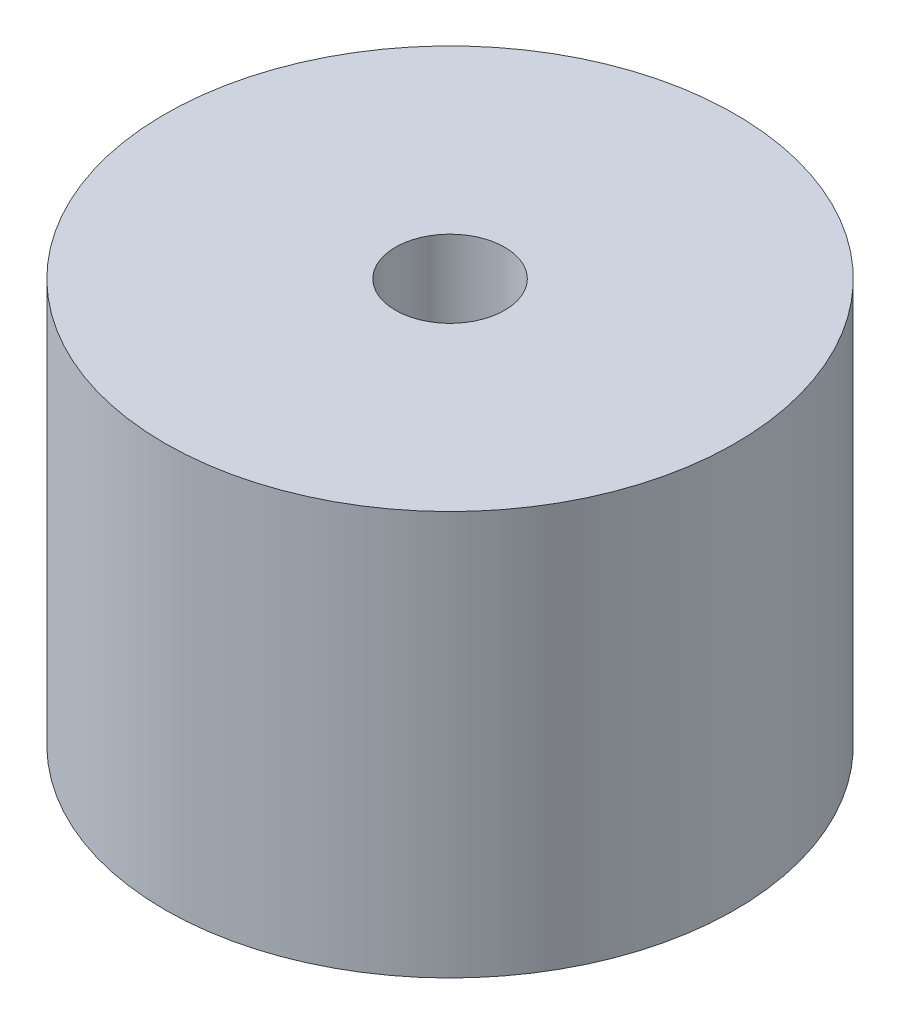
ISO-10303-21;
HEADER;
FILE_DESCRIPTION(('STEP AP214'),'2;1');
FILE_NAME('part.step','',(''),(''),'','','');
FILE_SCHEMA(('AUTOMOTIVE_DESIGN { 1 0 10303 214 1 1 1 1 }'));
ENDSEC;
DATA;
#1=APPLICATION_CONTEXT('core data for automotive mechanical design processes');
#2=APPLICATION_PROTOCOL_DEFINITION('international standard','automotive_design',2000,#1);
#3=PRODUCT_CONTEXT('',#1,'mechanical');
#4=PRODUCT('Part','Part','',(#3));
#5=PRODUCT_RELATED_PRODUCT_CATEGORY('part','',(#4));
#6=PRODUCT_DEFINITION_FORMATION('','',#4);
#7=PRODUCT_DEFINITION_CONTEXT('part definition',#1,'design');
#8=PRODUCT_DEFINITION('design','',#6,#7);
#9=PRODUCT_DEFINITION_SHAPE('','',#8);
#10=(LENGTH_UNIT() NAMED_UNIT(*) SI_UNIT(.MILLI.,.METRE.));
#11=(NAMED_UNIT(*) PLANE_ANGLE_UNIT() SI_UNIT($,.RADIAN.));
#12=(NAMED_UNIT(*) SI_UNIT($,.STERADIAN.) SOLID_ANGLE_UNIT());
#13=UNCERTAINTY_MEASURE_WITH_UNIT(LENGTH_MEASURE(1.E-05),#10,'distance_accuracy_value','');
#14=(GEOMETRIC_REPRESENTATION_CONTEXT(3) GLOBAL_UNCERTAINTY_ASSIGNED_CONTEXT((#13)) GLOBAL_UNIT_ASSIGNED_CONTEXT((#10,
#11,#12)) REPRESENTATION_CONTEXT('',''));
#15=CARTESIAN_POINT('',(0.,0.,0.));
#16=DIRECTION('',(0.,0.,1.));
#17=DIRECTION('',(1.,0.,0.));
#18=AXIS2_PLACEMENT_3D('',#15,#16,#17);
#19=CARTESIAN_POINT('',(0.,8.5,0.));
#20=DIRECTION('',(0.,-1.,0.));
#21=DIRECTION('',(0.,0.,-1.));
#22=AXIS2_PLACEMENT_3D('',#19,#20,#21);
#23=CYLINDRICAL_SURFACE('',#22,6.);
#24=CARTESIAN_POINT('',(0.,8.5,0.));
#25=DIRECTION('',(0.,1.,0.));
#26=DIRECTION('',(0.,0.,1.));
#27=AXIS2_PLACEMENT_3D('',#24,#25,#26);
#28=CIRCLE('',#27,6.);
#29=CARTESIAN_POINT('',(0.,8.5,6.));
#30=VERTEX_POINT('',#29);
#31=EDGE_CURVE('E10',#30,#30,#28,.T.);
#32=ORIENTED_EDGE('',*,*,#31,.F.);
#33=EDGE_LOOP('',(#32));
#34=FACE_BOUND('',#33,.T.);
#35=CARTESIAN_POINT('',(0.,0.,0.));
#36=DIRECTION('',(0.,1.,0.));
#37=DIRECTION('',(0.,0.,1.));
#38=AXIS2_PLACEMENT_3D('',#35,#36,#37);
#39=CIRCLE('',#38,6.);
#40=CARTESIAN_POINT('',(0.,0.,6.));
#41=VERTEX_POINT('',#40);
#42=EDGE_CURVE('E33',#41,#41,#39,.T.);
#43=ORIENTED_EDGE('',*,*,#42,.T.);
#44=EDGE_LOOP('',(#43));
#45=FACE_BOUND('',#44,.T.);
#46=ADVANCED_FACE('F30',(#34,#45),#23,.T.);
#47=CARTESIAN_POINT('',(0.,8.5,0.));
#48=DIRECTION('',(0.,1.,0.));
#49=DIRECTION('',(0.,0.,1.));
#50=AXIS2_PLACEMENT_3D('',#47,#48,#49);
#51=PLANE('',#50);
#52=CARTESIAN_POINT('',(0.,8.5,0.));
#53=DIRECTION('',(0.,1.,0.));
#54=DIRECTION('',(0.,0.,1.));
#55=AXIS2_PLACEMENT_3D('',#52,#53,#54);
#56=CIRCLE('',#55,1.15);
#57=CARTESIAN_POINT('',(0.,8.5,1.15));
#58=VERTEX_POINT('',#57);
#59=EDGE_CURVE('E42',#58,#58,#56,.T.);
#60=ORIENTED_EDGE('',*,*,#59,.F.);
#61=EDGE_LOOP('',(#60));
#62=FACE_BOUND('',#61,.T.);
#63=ORIENTED_EDGE('',*,*,#31,.T.);
#64=EDGE_LOOP('',(#63));
#65=FACE_BOUND('',#64,.T.);
#66=ADVANCED_FACE('F57',(#62,#65),#51,.T.);
#67=CARTESIAN_POINT('',(0.,0.,0.));
#68=DIRECTION('',(0.,1.,0.));
#69=DIRECTION('',(0.,0.,1.));
#70=AXIS2_PLACEMENT_3D('',#67,#68,#69);
#71=PLANE('',#70);
#72=ORIENTED_EDGE('',*,*,#42,.F.);
#73=EDGE_LOOP('',(#72));
#74=FACE_BOUND('',#73,.T.);
#75=ADVANCED_FACE('F53',(#74),#71,.F.);
#76=CARTESIAN_POINT('',(0.,5.5,0.));
#77=DIRECTION('',(0.,1.,0.));
#78=DIRECTION('',(0.,0.,1.));
#79=AXIS2_PLACEMENT_3D('',#76,#77,#78);
#80=CYLINDRICAL_SURFACE('',#79,1.15);
#81=CARTESIAN_POINT('',(0.,5.5,0.));
#82=DIRECTION('',(0.,1.,0.));
#83=DIRECTION('',(0.,0.,1.));
#84=AXIS2_PLACEMENT_3D('',#81,#82,#83);
#85=CIRCLE('',#84,1.15);
#86=CARTESIAN_POINT('',(0.,5.5,1.15));
#87=VERTEX_POINT('',#86);
#88=EDGE_CURVE('E40',#87,#87,#85,.T.);
#89=ORIENTED_EDGE('',*,*,#88,.F.);
#90=EDGE_LOOP('',(#89));
#91=FACE_BOUND('',#90,.T.);
#92=ORIENTED_EDGE('',*,*,#59,.T.);
#93=EDGE_LOOP('',(#92));
#94=FACE_BOUND('',#93,.T.);
#95=ADVANCED_FACE('F50',(#91,#94),#80,.F.);
#96=CARTESIAN_POINT('',(0.,5.5,0.));
#97=DIRECTION('',(0.,1.,0.));
#98=DIRECTION('',(0.,0.,1.));
#99=AXIS2_PLACEMENT_3D('',#96,#97,#98);
#100=PLANE('',#99);
#101=ORIENTED_EDGE('',*,*,#88,.T.);
#102=EDGE_LOOP('',(#101));
#103=FACE_BOUND('',#102,.T.);
#104=ADVANCED_FACE('F48',(#103),#100,.T.);
#105=CLOSED_SHELL('',(#46,#66,#75,#95,#104));
#106=MANIFOLD_SOLID_BREP('B2',#105);
#107=ADVANCED_BREP_SHAPE_REPRESENTATION('',(#18,#106),#14);
#108=SHAPE_DEFINITION_REPRESENTATION(#9,#107);
ENDSEC;
END-ISO-10303-21;
